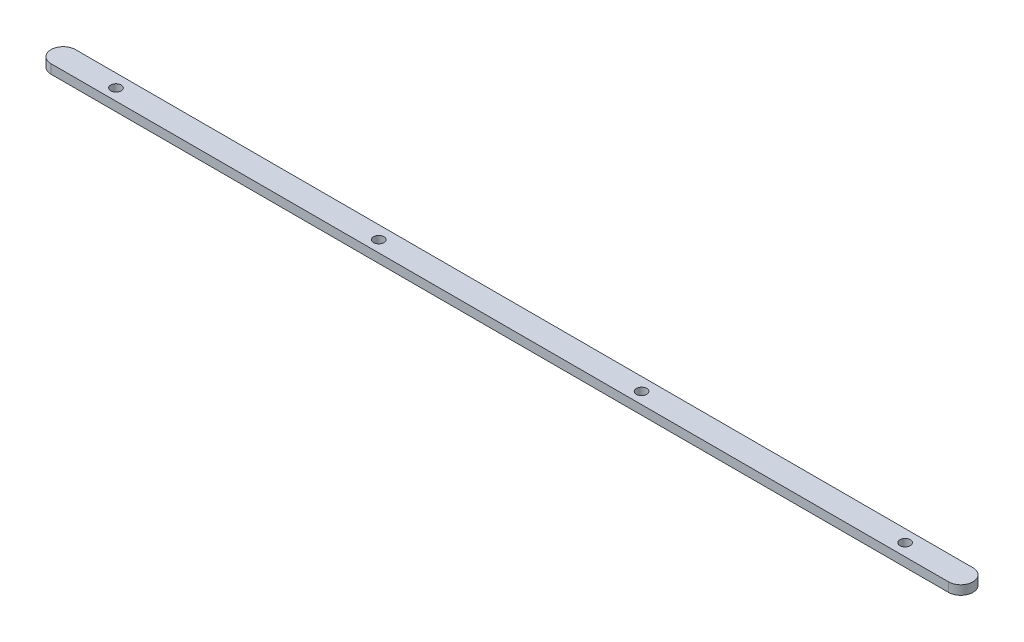
ISO-10303-21;
HEADER;
FILE_DESCRIPTION(('STEP AP214'),'2;1');
FILE_NAME('part.step','',(''),(''),'','','');
FILE_SCHEMA(('AUTOMOTIVE_DESIGN { 1 0 10303 214 1 1 1 1 }'));
ENDSEC;
DATA;
#1=APPLICATION_CONTEXT('core data for automotive mechanical design processes');
#2=APPLICATION_PROTOCOL_DEFINITION('international standard','automotive_design',2000,#1);
#3=PRODUCT_CONTEXT('',#1,'mechanical');
#4=PRODUCT('Part','Part','',(#3));
#5=PRODUCT_RELATED_PRODUCT_CATEGORY('part','',(#4));
#6=PRODUCT_DEFINITION_FORMATION('','',#4);
#7=PRODUCT_DEFINITION_CONTEXT('part definition',#1,'design');
#8=PRODUCT_DEFINITION('design','',#6,#7);
#9=PRODUCT_DEFINITION_SHAPE('','',#8);
#10=(LENGTH_UNIT() NAMED_UNIT(*) SI_UNIT(.MILLI.,.METRE.));
#11=(NAMED_UNIT(*) PLANE_ANGLE_UNIT() SI_UNIT($,.RADIAN.));
#12=(NAMED_UNIT(*) SI_UNIT($,.STERADIAN.) SOLID_ANGLE_UNIT());
#13=UNCERTAINTY_MEASURE_WITH_UNIT(LENGTH_MEASURE(1.E-05),#10,'distance_accuracy_value','');
#14=(GEOMETRIC_REPRESENTATION_CONTEXT(3) GLOBAL_UNCERTAINTY_ASSIGNED_CONTEXT((#13)) GLOBAL_UNIT_ASSIGNED_CONTEXT((#10,
#11,#12)) REPRESENTATION_CONTEXT('',''));
#15=CARTESIAN_POINT('',(0.,0.,0.));
#16=DIRECTION('',(0.,0.,1.));
#17=DIRECTION('',(1.,0.,0.));
#18=AXIS2_PLACEMENT_3D('',#15,#16,#17);
#19=CARTESIAN_POINT('',(-129.944369320198,3.,-4.18448160391141));
#20=DIRECTION('',(0.,1.,0.));
#21=DIRECTION('',(0.,0.,1.));
#22=AXIS2_PLACEMENT_3D('',#19,#20,#21);
#23=PLANE('',#22);
#24=CARTESIAN_POINT('',(-112.444369320198,3.,-3.93448160391141));
#25=DIRECTION('',(0.,1.,0.));
#26=DIRECTION('',(0.,0.,1.));
#27=AXIS2_PLACEMENT_3D('',#24,#25,#26);
#28=CIRCLE('',#27,1.69999999999999);
#29=CARTESIAN_POINT('',(-112.444369320198,3.,-2.23448160391142));
#30=VERTEX_POINT('',#29);
#31=EDGE_CURVE('E139',#30,#30,#28,.T.);
#32=ORIENTED_EDGE('',*,*,#31,.F.);
#33=EDGE_LOOP('',(#32));
#34=FACE_BOUND('',#33,.T.);
#35=CARTESIAN_POINT('',(145.555630679802,3.,-4.18448160391141));
#36=DIRECTION('',(0.,1.,0.));
#37=DIRECTION('',(0.,0.,1.));
#38=AXIS2_PLACEMENT_3D('',#35,#36,#37);
#39=CIRCLE('',#38,1.69999999999998);
#40=CARTESIAN_POINT('',(145.555630679802,3.,-2.48448160391143));
#41=VERTEX_POINT('',#40);
#42=EDGE_CURVE('E105',#41,#41,#39,.T.);
#43=ORIENTED_EDGE('',*,*,#42,.F.);
#44=EDGE_LOOP('',(#43));
#45=FACE_BOUND('',#44,.T.);
#46=CARTESIAN_POINT('',(-129.944369320198,3.,-4.18448160391141));
#47=DIRECTION('',(0.,1.,0.));
#48=DIRECTION('',(0.,0.,1.));
#49=AXIS2_PLACEMENT_3D('',#46,#47,#48);
#50=CIRCLE('',#49,4.);
#51=CARTESIAN_POINT('',(-129.944369320198,3.,-8.18448160391141));
#52=VERTEX_POINT('',#51);
#53=CARTESIAN_POINT('',(-129.944369320198,3.,-0.184481603911407));
#54=VERTEX_POINT('',#53);
#55=EDGE_CURVE('E84',#52,#54,#50,.T.);
#56=ORIENTED_EDGE('',*,*,#55,.T.);
#57=DIRECTION('',(1.,0.,0.));
#58=VECTOR('',#57,1.);
#59=CARTESIAN_POINT('',(-129.944369320198,3.,-0.184481603911407));
#60=LINE('',#59,#58);
#61=CARTESIAN_POINT('',(163.754980679802,3.,-0.184481603911407));
#62=VERTEX_POINT('',#61);
#63=EDGE_CURVE('E87',#54,#62,#60,.T.);
#64=ORIENTED_EDGE('',*,*,#63,.T.);
#65=CARTESIAN_POINT('',(163.754980679802,3.,-4.18448160391141));
#66=DIRECTION('',(0.,1.,0.));
#67=DIRECTION('',(0.,0.,1.));
#68=AXIS2_PLACEMENT_3D('',#65,#66,#67);
#69=CIRCLE('',#68,4.);
#70=CARTESIAN_POINT('',(163.754980679802,3.,-8.18448160391141));
#71=VERTEX_POINT('',#70);
#72=EDGE_CURVE('E91',#62,#71,#69,.T.);
#73=ORIENTED_EDGE('',*,*,#72,.T.);
#74=DIRECTION('',(-1.,0.,0.));
#75=VECTOR('',#74,1.);
#76=CARTESIAN_POINT('',(163.754980679802,3.,-8.18448160391141));
#77=LINE('',#76,#75);
#78=EDGE_CURVE('E56',#71,#52,#77,.T.);
#79=ORIENTED_EDGE('',*,*,#78,.T.);
#80=EDGE_LOOP('',(#56,#64,#73,#79));
#81=FACE_BOUND('',#80,.T.);
#82=CARTESIAN_POINT('',(59.5556306798022,3.,-3.93448160391141));
#83=DIRECTION('',(0.,1.,0.));
#84=DIRECTION('',(0.,0.,1.));
#85=AXIS2_PLACEMENT_3D('',#82,#83,#84);
#86=CIRCLE('',#85,1.70000000000001);
#87=CARTESIAN_POINT('',(59.5556306798022,3.,-2.2344816039114));
#88=VERTEX_POINT('',#87);
#89=EDGE_CURVE('E143',#88,#88,#86,.T.);
#90=ORIENTED_EDGE('',*,*,#89,.F.);
#91=EDGE_LOOP('',(#90));
#92=FACE_BOUND('',#91,.T.);
#93=CARTESIAN_POINT('',(-26.4443693201979,3.,-3.93448160391141));
#94=DIRECTION('',(0.,1.,0.));
#95=DIRECTION('',(0.,0.,1.));
#96=AXIS2_PLACEMENT_3D('',#93,#94,#95);
#97=CIRCLE('',#96,1.69999999999999);
#98=CARTESIAN_POINT('',(-26.4443693201979,3.,-2.23448160391142));
#99=VERTEX_POINT('',#98);
#100=EDGE_CURVE('E134',#99,#99,#97,.T.);
#101=ORIENTED_EDGE('',*,*,#100,.F.);
#102=EDGE_LOOP('',(#101));
#103=FACE_BOUND('',#102,.T.);
#104=ADVANCED_FACE('F39',(#34,#45,#81,#92,#103),#23,.T.);
#105=CARTESIAN_POINT('',(-129.944369320198,0.,-4.18448160391141));
#106=DIRECTION('',(0.,1.,0.));
#107=DIRECTION('',(0.,0.,1.));
#108=AXIS2_PLACEMENT_3D('',#105,#106,#107);
#109=PLANE('',#108);
#110=CARTESIAN_POINT('',(-129.944369320198,0.,-4.18448160391141));
#111=DIRECTION('',(0.,1.,0.));
#112=DIRECTION('',(0.,0.,1.));
#113=AXIS2_PLACEMENT_3D('',#110,#111,#112);
#114=CIRCLE('',#113,4.);
#115=CARTESIAN_POINT('',(-129.944369320198,0.,-8.18448160391141));
#116=VERTEX_POINT('',#115);
#117=CARTESIAN_POINT('',(-129.944369320198,0.,-0.184481603911407));
#118=VERTEX_POINT('',#117);
#119=EDGE_CURVE('E79',#116,#118,#114,.T.);
#120=ORIENTED_EDGE('',*,*,#119,.F.);
#121=DIRECTION('',(-1.,0.,0.));
#122=VECTOR('',#121,1.);
#123=CARTESIAN_POINT('',(163.754980679802,0.,-8.18448160391141));
#124=LINE('',#123,#122);
#125=CARTESIAN_POINT('',(163.754980679802,0.,-8.18448160391141));
#126=VERTEX_POINT('',#125);
#127=EDGE_CURVE('E108',#126,#116,#124,.T.);
#128=ORIENTED_EDGE('',*,*,#127,.F.);
#129=CARTESIAN_POINT('',(163.754980679802,0.,-4.18448160391141));
#130=DIRECTION('',(0.,1.,0.));
#131=DIRECTION('',(0.,0.,1.));
#132=AXIS2_PLACEMENT_3D('',#129,#130,#131);
#133=CIRCLE('',#132,4.);
#134=CARTESIAN_POINT('',(163.754980679802,0.,-0.184481603911407));
#135=VERTEX_POINT('',#134);
#136=EDGE_CURVE('E72',#135,#126,#133,.T.);
#137=ORIENTED_EDGE('',*,*,#136,.F.);
#138=DIRECTION('',(1.,0.,0.));
#139=VECTOR('',#138,1.);
#140=CARTESIAN_POINT('',(-129.944369320198,0.,-0.184481603911407));
#141=LINE('',#140,#139);
#142=EDGE_CURVE('E96',#118,#135,#141,.T.);
#143=ORIENTED_EDGE('',*,*,#142,.F.);
#144=EDGE_LOOP('',(#120,#128,#137,#143));
#145=FACE_BOUND('',#144,.T.);
#146=CARTESIAN_POINT('',(145.555630679802,0.,-4.18448160391141));
#147=DIRECTION('',(0.,1.,0.));
#148=DIRECTION('',(0.,0.,1.));
#149=AXIS2_PLACEMENT_3D('',#146,#147,#148);
#150=CIRCLE('',#149,1.69999999999998);
#151=CARTESIAN_POINT('',(145.555630679802,0.,-2.48448160391143));
#152=VERTEX_POINT('',#151);
#153=EDGE_CURVE('E121',#152,#152,#150,.T.);
#154=ORIENTED_EDGE('',*,*,#153,.T.);
#155=EDGE_LOOP('',(#154));
#156=FACE_BOUND('',#155,.T.);
#157=CARTESIAN_POINT('',(59.5556306798022,0.,-3.93448160391141));
#158=DIRECTION('',(0.,1.,0.));
#159=DIRECTION('',(0.,0.,1.));
#160=AXIS2_PLACEMENT_3D('',#157,#158,#159);
#161=CIRCLE('',#160,1.70000000000001);
#162=CARTESIAN_POINT('',(59.5556306798022,0.,-2.2344816039114));
#163=VERTEX_POINT('',#162);
#164=EDGE_CURVE('E125',#163,#163,#161,.T.);
#165=ORIENTED_EDGE('',*,*,#164,.T.);
#166=EDGE_LOOP('',(#165));
#167=FACE_BOUND('',#166,.T.);
#168=CARTESIAN_POINT('',(-112.444369320198,0.,-3.93448160391141));
#169=DIRECTION('',(0.,1.,0.));
#170=DIRECTION('',(0.,0.,1.));
#171=AXIS2_PLACEMENT_3D('',#168,#169,#170);
#172=CIRCLE('',#171,1.69999999999999);
#173=CARTESIAN_POINT('',(-112.444369320198,0.,-2.23448160391142));
#174=VERTEX_POINT('',#173);
#175=EDGE_CURVE('E129',#174,#174,#172,.T.);
#176=ORIENTED_EDGE('',*,*,#175,.T.);
#177=EDGE_LOOP('',(#176));
#178=FACE_BOUND('',#177,.T.);
#179=CARTESIAN_POINT('',(-26.4443693201979,0.,-3.93448160391141));
#180=DIRECTION('',(0.,1.,0.));
#181=DIRECTION('',(0.,0.,1.));
#182=AXIS2_PLACEMENT_3D('',#179,#180,#181);
#183=CIRCLE('',#182,1.69999999999999);
#184=CARTESIAN_POINT('',(-26.4443693201979,0.,-2.23448160391142));
#185=VERTEX_POINT('',#184);
#186=EDGE_CURVE('E132',#185,#185,#183,.T.);
#187=ORIENTED_EDGE('',*,*,#186,.T.);
#188=EDGE_LOOP('',(#187));
#189=FACE_BOUND('',#188,.T.);
#190=ADVANCED_FACE('F114',(#145,#156,#167,#178,#189),#109,.F.);
#191=CARTESIAN_POINT('',(-129.944369320198,3.,-4.18448160391141));
#192=DIRECTION('',(0.,-1.,0.));
#193=DIRECTION('',(0.,0.,-1.));
#194=AXIS2_PLACEMENT_3D('',#191,#192,#193);
#195=CYLINDRICAL_SURFACE('',#194,4.);
#196=ORIENTED_EDGE('',*,*,#119,.T.);
#197=DIRECTION('',(0.,-1.,0.));
#198=VECTOR('',#197,1.);
#199=CARTESIAN_POINT('',(-129.944369320198,3.,-0.184481603911407));
#200=LINE('',#199,#198);
#201=EDGE_CURVE('E11',#54,#118,#200,.T.);
#202=ORIENTED_EDGE('',*,*,#201,.F.);
#203=ORIENTED_EDGE('',*,*,#55,.F.);
#204=DIRECTION('',(0.,-1.,0.));
#205=VECTOR('',#204,1.);
#206=CARTESIAN_POINT('',(-129.944369320198,3.,-8.18448160391141));
#207=LINE('',#206,#205);
#208=EDGE_CURVE('E100',#52,#116,#207,.T.);
#209=ORIENTED_EDGE('',*,*,#208,.T.);
#210=EDGE_LOOP('',(#196,#202,#203,#209));
#211=FACE_BOUND('',#210,.T.);
#212=ADVANCED_FACE('F41',(#211),#195,.T.);
#213=CARTESIAN_POINT('',(-129.944369320198,3.,-0.184481603911407));
#214=DIRECTION('',(0.,0.,-1.));
#215=DIRECTION('',(-1.,0.,0.));
#216=AXIS2_PLACEMENT_3D('',#213,#214,#215);
#217=PLANE('',#216);
#218=ORIENTED_EDGE('',*,*,#142,.T.);
#219=DIRECTION('',(0.,-1.,0.));
#220=VECTOR('',#219,1.);
#221=CARTESIAN_POINT('',(163.754980679802,3.,-0.184481603911407));
#222=LINE('',#221,#220);
#223=EDGE_CURVE('E48',#62,#135,#222,.T.);
#224=ORIENTED_EDGE('',*,*,#223,.F.);
#225=ORIENTED_EDGE('',*,*,#63,.F.);
#226=ORIENTED_EDGE('',*,*,#201,.T.);
#227=EDGE_LOOP('',(#218,#224,#225,#226));
#228=FACE_BOUND('',#227,.T.);
#229=ADVANCED_FACE('F95',(#228),#217,.F.);
#230=CARTESIAN_POINT('',(163.754980679802,3.,-4.18448160391141));
#231=DIRECTION('',(0.,-1.,0.));
#232=DIRECTION('',(0.,0.,-1.));
#233=AXIS2_PLACEMENT_3D('',#230,#231,#232);
#234=CYLINDRICAL_SURFACE('',#233,4.);
#235=ORIENTED_EDGE('',*,*,#136,.T.);
#236=DIRECTION('',(0.,-1.,0.));
#237=VECTOR('',#236,1.);
#238=CARTESIAN_POINT('',(163.754980679802,3.,-8.18448160391141));
#239=LINE('',#238,#237);
#240=EDGE_CURVE('E97',#71,#126,#239,.T.);
#241=ORIENTED_EDGE('',*,*,#240,.F.);
#242=ORIENTED_EDGE('',*,*,#72,.F.);
#243=ORIENTED_EDGE('',*,*,#223,.T.);
#244=EDGE_LOOP('',(#235,#241,#242,#243));
#245=FACE_BOUND('',#244,.T.);
#246=ADVANCED_FACE('F98',(#245),#234,.T.);
#247=CARTESIAN_POINT('',(163.754980679802,3.,-8.18448160391141));
#248=DIRECTION('',(0.,0.,1.));
#249=DIRECTION('',(1.,0.,0.));
#250=AXIS2_PLACEMENT_3D('',#247,#248,#249);
#251=PLANE('',#250);
#252=ORIENTED_EDGE('',*,*,#127,.T.);
#253=ORIENTED_EDGE('',*,*,#208,.F.);
#254=ORIENTED_EDGE('',*,*,#78,.F.);
#255=ORIENTED_EDGE('',*,*,#240,.T.);
#256=EDGE_LOOP('',(#252,#253,#254,#255));
#257=FACE_BOUND('',#256,.T.);
#258=ADVANCED_FACE('F113',(#257),#251,.F.);
#259=CARTESIAN_POINT('',(145.555630679802,3.,-4.18448160391141));
#260=DIRECTION('',(0.,-1.,0.));
#261=DIRECTION('',(0.,0.,-1.));
#262=AXIS2_PLACEMENT_3D('',#259,#260,#261);
#263=CYLINDRICAL_SURFACE('',#262,1.69999999999998);
#264=ORIENTED_EDGE('',*,*,#42,.T.);
#265=EDGE_LOOP('',(#264));
#266=FACE_BOUND('',#265,.T.);
#267=ORIENTED_EDGE('',*,*,#153,.F.);
#268=EDGE_LOOP('',(#267));
#269=FACE_BOUND('',#268,.T.);
#270=ADVANCED_FACE('F151',(#266,#269),#263,.F.);
#271=CARTESIAN_POINT('',(59.5556306798022,3.,-3.93448160391141));
#272=DIRECTION('',(0.,-1.,0.));
#273=DIRECTION('',(0.,0.,-1.));
#274=AXIS2_PLACEMENT_3D('',#271,#272,#273);
#275=CYLINDRICAL_SURFACE('',#274,1.70000000000001);
#276=ORIENTED_EDGE('',*,*,#89,.T.);
#277=EDGE_LOOP('',(#276));
#278=FACE_BOUND('',#277,.T.);
#279=ORIENTED_EDGE('',*,*,#164,.F.);
#280=EDGE_LOOP('',(#279));
#281=FACE_BOUND('',#280,.T.);
#282=ADVANCED_FACE('F213',(#278,#281),#275,.F.);
#283=CARTESIAN_POINT('',(-112.444369320198,3.,-3.93448160391141));
#284=DIRECTION('',(0.,-1.,0.));
#285=DIRECTION('',(0.,0.,-1.));
#286=AXIS2_PLACEMENT_3D('',#283,#284,#285);
#287=CYLINDRICAL_SURFACE('',#286,1.69999999999999);
#288=ORIENTED_EDGE('',*,*,#31,.T.);
#289=EDGE_LOOP('',(#288));
#290=FACE_BOUND('',#289,.T.);
#291=ORIENTED_EDGE('',*,*,#175,.F.);
#292=EDGE_LOOP('',(#291));
#293=FACE_BOUND('',#292,.T.);
#294=ADVANCED_FACE('F220',(#290,#293),#287,.F.);
#295=CARTESIAN_POINT('',(-26.4443693201979,3.,-3.93448160391141));
#296=DIRECTION('',(0.,-1.,0.));
#297=DIRECTION('',(0.,0.,-1.));
#298=AXIS2_PLACEMENT_3D('',#295,#296,#297);
#299=CYLINDRICAL_SURFACE('',#298,1.69999999999999);
#300=ORIENTED_EDGE('',*,*,#100,.T.);
#301=EDGE_LOOP('',(#300));
#302=FACE_BOUND('',#301,.T.);
#303=ORIENTED_EDGE('',*,*,#186,.F.);
#304=EDGE_LOOP('',(#303));
#305=FACE_BOUND('',#304,.T.);
#306=ADVANCED_FACE('F228',(#302,#305),#299,.F.);
#307=CLOSED_SHELL('',(#104,#190,#212,#229,#246,#258,#270,#282,#294,#306));
#308=MANIFOLD_SOLID_BREP('B2',#307);
#309=ADVANCED_BREP_SHAPE_REPRESENTATION('',(#18,#308),#14);
#310=SHAPE_DEFINITION_REPRESENTATION(#9,#309);
ENDSEC;
END-ISO-10303-21;
